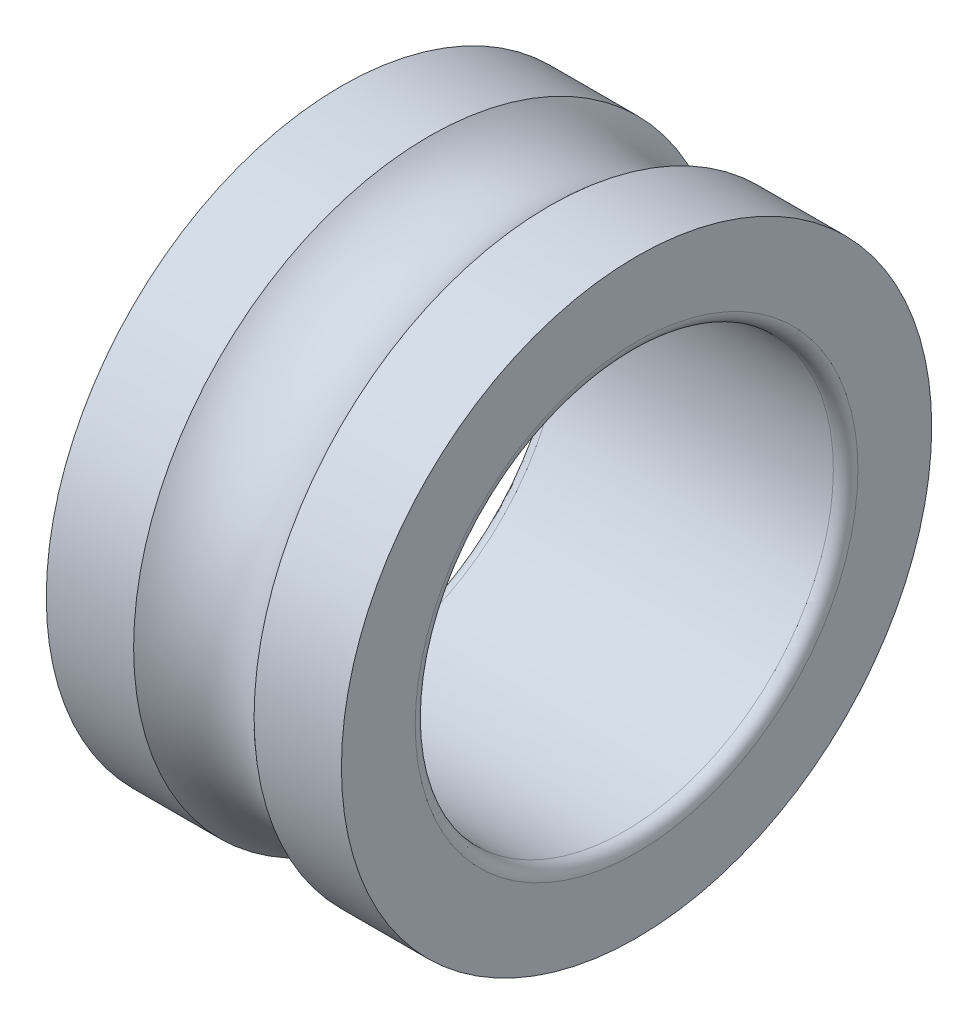
ISO-10303-21;
HEADER;
FILE_DESCRIPTION(('STEP AP214'),'2;1');
FILE_NAME('part.step','',(''),(''),'','','');
FILE_SCHEMA(('AUTOMOTIVE_DESIGN { 1 0 10303 214 1 1 1 1 }'));
ENDSEC;
DATA;
#1=APPLICATION_CONTEXT('core data for automotive mechanical design processes');
#2=APPLICATION_PROTOCOL_DEFINITION('international standard','automotive_design',2000,#1);
#3=PRODUCT_CONTEXT('',#1,'mechanical');
#4=PRODUCT('Part','Part','',(#3));
#5=PRODUCT_RELATED_PRODUCT_CATEGORY('part','',(#4));
#6=PRODUCT_DEFINITION_FORMATION('','',#4);
#7=PRODUCT_DEFINITION_CONTEXT('part definition',#1,'design');
#8=PRODUCT_DEFINITION('design','',#6,#7);
#9=PRODUCT_DEFINITION_SHAPE('','',#8);
#10=(LENGTH_UNIT() NAMED_UNIT(*) SI_UNIT(.MILLI.,.METRE.));
#11=(NAMED_UNIT(*) PLANE_ANGLE_UNIT() SI_UNIT($,.RADIAN.));
#12=(NAMED_UNIT(*) SI_UNIT($,.STERADIAN.) SOLID_ANGLE_UNIT());
#13=UNCERTAINTY_MEASURE_WITH_UNIT(LENGTH_MEASURE(1.E-05),#10,'distance_accuracy_value','');
#14=(GEOMETRIC_REPRESENTATION_CONTEXT(3) GLOBAL_UNCERTAINTY_ASSIGNED_CONTEXT((#13)) GLOBAL_UNIT_ASSIGNED_CONTEXT((#10,
#11,#12)) REPRESENTATION_CONTEXT('',''));
#15=CARTESIAN_POINT('',(0.,0.,0.));
#16=DIRECTION('',(0.,0.,1.));
#17=DIRECTION('',(1.,0.,0.));
#18=AXIS2_PLACEMENT_3D('',#15,#16,#17);
#19=CARTESIAN_POINT('',(-52.6596955990454,0.,0.));
#20=DIRECTION('',(-1.,0.,0.));
#21=DIRECTION('',(0.,0.,1.));
#22=AXIS2_PLACEMENT_3D('',#19,#20,#21);
#23=CYLINDRICAL_SURFACE('',#22,12.);
#24=CARTESIAN_POINT('',(7.20882306990444,0.,0.));
#25=DIRECTION('',(-1.,0.,0.));
#26=DIRECTION('',(0.,0.,1.));
#27=AXIS2_PLACEMENT_3D('',#24,#25,#26);
#28=CIRCLE('',#27,12.);
#29=CARTESIAN_POINT('',(7.20882306990444,0.,12.));
#30=VERTEX_POINT('',#29);
#31=EDGE_CURVE('E10',#30,#30,#28,.T.);
#32=ORIENTED_EDGE('',*,*,#31,.F.);
#33=EDGE_LOOP('',(#32));
#34=FACE_BOUND('',#33,.T.);
#35=CARTESIAN_POINT('',(10.7593333271213,0.,0.));
#36=DIRECTION('',(-1.,0.,0.));
#37=DIRECTION('',(0.,0.,1.));
#38=AXIS2_PLACEMENT_3D('',#35,#36,#37);
#39=CIRCLE('',#38,12.);
#40=CARTESIAN_POINT('',(10.7593333271213,0.,12.));
#41=VERTEX_POINT('',#40);
#42=EDGE_CURVE('E63',#41,#41,#39,.T.);
#43=ORIENTED_EDGE('',*,*,#42,.T.);
#44=EDGE_LOOP('',(#43));
#45=FACE_BOUND('',#44,.T.);
#46=ADVANCED_FACE('F35',(#34,#45),#23,.T.);
#47=CARTESIAN_POINT('',(4.75933332712126,0.,0.));
#48=DIRECTION('',(-1.,0.,0.));
#49=DIRECTION('',(0.,0.,1.));
#50=AXIS2_PLACEMENT_3D('',#47,#48,#49);
#51=TOROIDAL_SURFACE('',#50,14.5,3.5);
#52=CARTESIAN_POINT('',(2.30984358433808,0.,0.));
#53=DIRECTION('',(-1.,0.,0.));
#54=DIRECTION('',(0.,0.,1.));
#55=AXIS2_PLACEMENT_3D('',#52,#53,#54);
#56=CIRCLE('',#55,12.);
#57=CARTESIAN_POINT('',(2.30984358433808,0.,12.));
#58=VERTEX_POINT('',#57);
#59=EDGE_CURVE('E41',#58,#58,#56,.T.);
#60=ORIENTED_EDGE('',*,*,#59,.F.);
#61=EDGE_LOOP('',(#60));
#62=FACE_BOUND('',#61,.T.);
#63=ORIENTED_EDGE('',*,*,#31,.T.);
#64=EDGE_LOOP('',(#63));
#65=FACE_BOUND('',#64,.T.);
#66=ADVANCED_FACE('F100',(#62,#65),#51,.F.);
#67=CARTESIAN_POINT('',(-52.6596955990454,0.,0.));
#68=DIRECTION('',(-1.,0.,0.));
#69=DIRECTION('',(0.,0.,1.));
#70=AXIS2_PLACEMENT_3D('',#67,#68,#69);
#71=CYLINDRICAL_SURFACE('',#70,12.);
#72=CARTESIAN_POINT('',(-1.24066667287874,0.,0.));
#73=DIRECTION('',(-1.,0.,0.));
#74=DIRECTION('',(0.,0.,1.));
#75=AXIS2_PLACEMENT_3D('',#72,#73,#74);
#76=CIRCLE('',#75,12.);
#77=CARTESIAN_POINT('',(-1.24066667287874,0.,12.));
#78=VERTEX_POINT('',#77);
#79=EDGE_CURVE('E45',#78,#78,#76,.T.);
#80=ORIENTED_EDGE('',*,*,#79,.F.);
#81=EDGE_LOOP('',(#80));
#82=FACE_BOUND('',#81,.T.);
#83=ORIENTED_EDGE('',*,*,#59,.T.);
#84=EDGE_LOOP('',(#83));
#85=FACE_BOUND('',#84,.T.);
#86=ADVANCED_FACE('F95',(#82,#85),#71,.T.);
#87=CARTESIAN_POINT('',(-1.24066667287874,12.,0.));
#88=DIRECTION('',(1.,0.,0.));
#89=DIRECTION('',(0.,0.,-1.));
#90=AXIS2_PLACEMENT_3D('',#87,#88,#89);
#91=PLANE('',#90);
#92=CARTESIAN_POINT('',(-1.24066667287874,0.,0.));
#93=DIRECTION('',(-1.,0.,0.));
#94=DIRECTION('',(0.,0.,1.));
#95=AXIS2_PLACEMENT_3D('',#92,#93,#94);
#96=CIRCLE('',#95,9.);
#97=CARTESIAN_POINT('',(-1.24066667287874,0.,9.));
#98=VERTEX_POINT('',#97);
#99=EDGE_CURVE('E49',#98,#98,#96,.T.);
#100=ORIENTED_EDGE('',*,*,#99,.F.);
#101=EDGE_LOOP('',(#100));
#102=FACE_BOUND('',#101,.T.);
#103=ORIENTED_EDGE('',*,*,#79,.T.);
#104=EDGE_LOOP('',(#103));
#105=FACE_BOUND('',#104,.T.);
#106=ADVANCED_FACE('F89',(#102,#105),#91,.F.);
#107=CARTESIAN_POINT('',(-0.740666672878737,0.,0.));
#108=DIRECTION('',(-1.,0.,0.));
#109=DIRECTION('',(0.,0.,1.));
#110=AXIS2_PLACEMENT_3D('',#107,#108,#109);
#111=TOROIDAL_SURFACE('',#110,9.,0.500000000000001);
#112=CARTESIAN_POINT('',(-0.74066667287874,0.,0.));
#113=DIRECTION('',(-1.,0.,0.));
#114=DIRECTION('',(0.,0.,1.));
#115=AXIS2_PLACEMENT_3D('',#112,#113,#114);
#116=CIRCLE('',#115,8.5);
#117=CARTESIAN_POINT('',(-0.74066667287874,0.,8.5));
#118=VERTEX_POINT('',#117);
#119=EDGE_CURVE('E54',#118,#118,#116,.T.);
#120=ORIENTED_EDGE('',*,*,#119,.F.);
#121=EDGE_LOOP('',(#120));
#122=FACE_BOUND('',#121,.T.);
#123=ORIENTED_EDGE('',*,*,#99,.T.);
#124=EDGE_LOOP('',(#123));
#125=FACE_BOUND('',#124,.T.);
#126=ADVANCED_FACE('F83',(#122,#125),#111,.T.);
#127=CARTESIAN_POINT('',(-52.6596955990454,0.,0.));
#128=DIRECTION('',(-1.,0.,0.));
#129=DIRECTION('',(0.,0.,1.));
#130=AXIS2_PLACEMENT_3D('',#127,#128,#129);
#131=CYLINDRICAL_SURFACE('',#130,8.5);
#132=CARTESIAN_POINT('',(10.2593333271213,0.,0.));
#133=DIRECTION('',(-1.,0.,0.));
#134=DIRECTION('',(0.,0.,1.));
#135=AXIS2_PLACEMENT_3D('',#132,#133,#134);
#136=CIRCLE('',#135,8.5);
#137=CARTESIAN_POINT('',(10.2593333271213,0.,8.5));
#138=VERTEX_POINT('',#137);
#139=EDGE_CURVE('E57',#138,#138,#136,.T.);
#140=ORIENTED_EDGE('',*,*,#139,.F.);
#141=EDGE_LOOP('',(#140));
#142=FACE_BOUND('',#141,.T.);
#143=ORIENTED_EDGE('',*,*,#119,.T.);
#144=EDGE_LOOP('',(#143));
#145=FACE_BOUND('',#144,.T.);
#146=ADVANCED_FACE('F77',(#142,#145),#131,.F.);
#147=CARTESIAN_POINT('',(10.2593333271213,0.,0.));
#148=DIRECTION('',(-1.,0.,0.));
#149=DIRECTION('',(0.,0.,1.));
#150=AXIS2_PLACEMENT_3D('',#147,#148,#149);
#151=TOROIDAL_SURFACE('',#150,9.,0.500000000000001);
#152=CARTESIAN_POINT('',(10.7593333271213,0.,0.));
#153=DIRECTION('',(-1.,0.,0.));
#154=DIRECTION('',(0.,0.,1.));
#155=AXIS2_PLACEMENT_3D('',#152,#153,#154);
#156=CIRCLE('',#155,9.);
#157=CARTESIAN_POINT('',(10.7593333271213,0.,9.));
#158=VERTEX_POINT('',#157);
#159=EDGE_CURVE('E60',#158,#158,#156,.T.);
#160=ORIENTED_EDGE('',*,*,#159,.F.);
#161=EDGE_LOOP('',(#160));
#162=FACE_BOUND('',#161,.T.);
#163=ORIENTED_EDGE('',*,*,#139,.T.);
#164=EDGE_LOOP('',(#163));
#165=FACE_BOUND('',#164,.T.);
#166=ADVANCED_FACE('F71',(#162,#165),#151,.T.);
#167=CARTESIAN_POINT('',(10.7593333271213,9.,0.));
#168=DIRECTION('',(-1.,0.,0.));
#169=DIRECTION('',(0.,0.,1.));
#170=AXIS2_PLACEMENT_3D('',#167,#168,#169);
#171=PLANE('',#170);
#172=ORIENTED_EDGE('',*,*,#42,.F.);
#173=EDGE_LOOP('',(#172));
#174=FACE_BOUND('',#173,.T.);
#175=ORIENTED_EDGE('',*,*,#159,.T.);
#176=EDGE_LOOP('',(#175));
#177=FACE_BOUND('',#176,.T.);
#178=ADVANCED_FACE('F68',(#174,#177),#171,.F.);
#179=CLOSED_SHELL('',(#46,#66,#86,#106,#126,#146,#166,#178));
#180=MANIFOLD_SOLID_BREP('B2',#179);
#181=ADVANCED_BREP_SHAPE_REPRESENTATION('',(#18,#180),#14);
#182=SHAPE_DEFINITION_REPRESENTATION(#9,#181);
ENDSEC;
END-ISO-10303-21;
